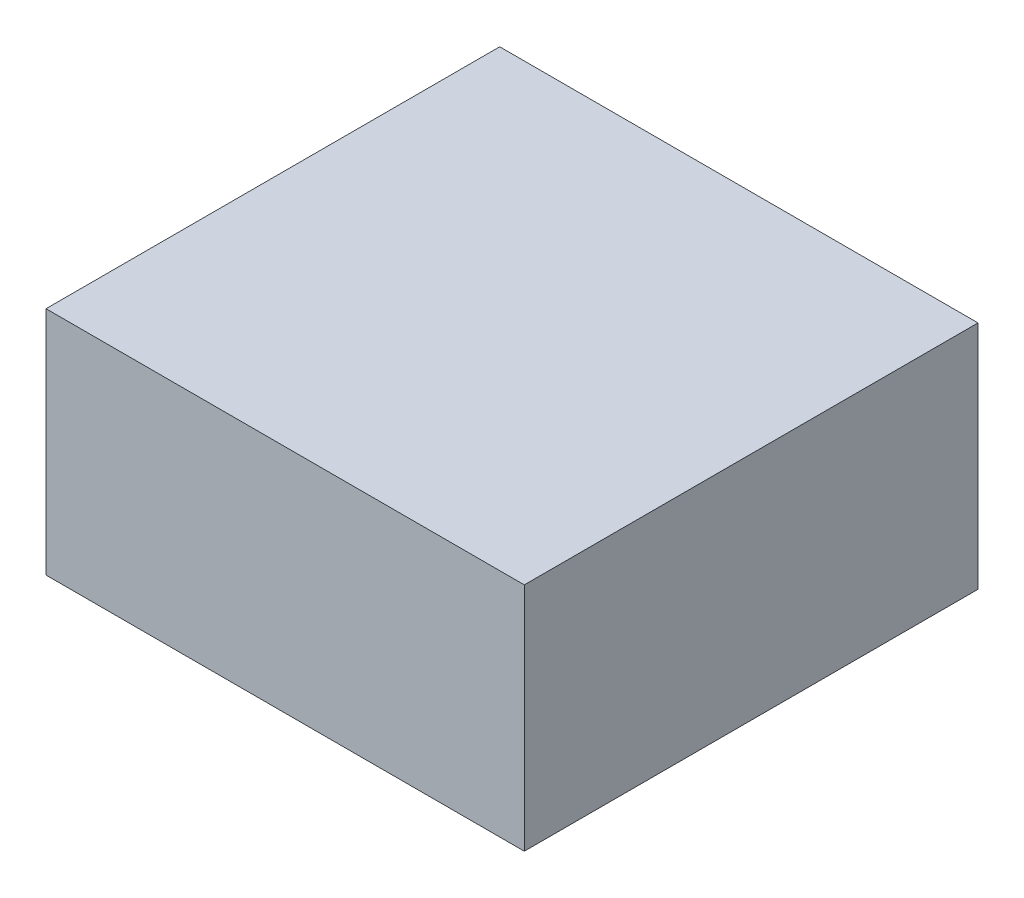
ISO-10303-21;
HEADER;
FILE_DESCRIPTION(('STEP AP214'),'2;1');
FILE_NAME('part.step','',(''),(''),'','','');
FILE_SCHEMA(('AUTOMOTIVE_DESIGN { 1 0 10303 214 1 1 1 1 }'));
ENDSEC;
DATA;
#1=APPLICATION_CONTEXT('core data for automotive mechanical design processes');
#2=APPLICATION_PROTOCOL_DEFINITION('international standard','automotive_design',2000,#1);
#3=PRODUCT_CONTEXT('',#1,'mechanical');
#4=PRODUCT('Part','Part','',(#3));
#5=PRODUCT_RELATED_PRODUCT_CATEGORY('part','',(#4));
#6=PRODUCT_DEFINITION_FORMATION('','',#4);
#7=PRODUCT_DEFINITION_CONTEXT('part definition',#1,'design');
#8=PRODUCT_DEFINITION('design','',#6,#7);
#9=PRODUCT_DEFINITION_SHAPE('','',#8);
#10=(LENGTH_UNIT() NAMED_UNIT(*) SI_UNIT(.MILLI.,.METRE.));
#11=(NAMED_UNIT(*) PLANE_ANGLE_UNIT() SI_UNIT($,.RADIAN.));
#12=(NAMED_UNIT(*) SI_UNIT($,.STERADIAN.) SOLID_ANGLE_UNIT());
#13=UNCERTAINTY_MEASURE_WITH_UNIT(LENGTH_MEASURE(1.E-05),#10,'distance_accuracy_value','');
#14=(GEOMETRIC_REPRESENTATION_CONTEXT(3) GLOBAL_UNCERTAINTY_ASSIGNED_CONTEXT((#13)) GLOBAL_UNIT_ASSIGNED_CONTEXT((#10,
#11,#12)) REPRESENTATION_CONTEXT('',''));
#15=CARTESIAN_POINT('',(0.,0.,0.));
#16=DIRECTION('',(0.,0.,1.));
#17=DIRECTION('',(1.,0.,0.));
#18=AXIS2_PLACEMENT_3D('',#15,#16,#17);
#19=CARTESIAN_POINT('',(39.497,-19.05,74.93));
#20=DIRECTION('',(-1.,0.,0.));
#21=DIRECTION('',(0.,0.,1.));
#22=AXIS2_PLACEMENT_3D('',#19,#20,#21);
#23=PLANE('',#22);
#24=DIRECTION('',(0.,1.,0.));
#25=VECTOR('',#24,1.);
#26=CARTESIAN_POINT('',(39.497,-19.05,0.));
#27=LINE('',#26,#25);
#28=CARTESIAN_POINT('',(39.497,-19.05,0.));
#29=VERTEX_POINT('',#28);
#30=CARTESIAN_POINT('',(39.497,19.05,0.));
#31=VERTEX_POINT('',#30);
#32=EDGE_CURVE('E95',#29,#31,#27,.T.);
#33=ORIENTED_EDGE('',*,*,#32,.T.);
#34=DIRECTION('',(0.,0.,-1.));
#35=VECTOR('',#34,1.);
#36=CARTESIAN_POINT('',(39.497,19.05,74.93));
#37=LINE('',#36,#35);
#38=CARTESIAN_POINT('',(39.497,19.05,74.93));
#39=VERTEX_POINT('',#38);
#40=EDGE_CURVE('E11',#39,#31,#37,.T.);
#41=ORIENTED_EDGE('',*,*,#40,.F.);
#42=DIRECTION('',(0.,1.,0.));
#43=VECTOR('',#42,1.);
#44=CARTESIAN_POINT('',(39.497,-19.05,74.93));
#45=LINE('',#44,#43);
#46=CARTESIAN_POINT('',(39.497,-19.05,74.93));
#47=VERTEX_POINT('',#46);
#48=EDGE_CURVE('E83',#47,#39,#45,.T.);
#49=ORIENTED_EDGE('',*,*,#48,.F.);
#50=DIRECTION('',(0.,0.,-1.));
#51=VECTOR('',#50,1.);
#52=CARTESIAN_POINT('',(39.497,-19.05,74.93));
#53=LINE('',#52,#51);
#54=EDGE_CURVE('E91',#47,#29,#53,.T.);
#55=ORIENTED_EDGE('',*,*,#54,.T.);
#56=EDGE_LOOP('',(#33,#41,#49,#55));
#57=FACE_BOUND('',#56,.T.);
#58=ADVANCED_FACE('F32',(#57),#23,.F.);
#59=CARTESIAN_POINT('',(-39.497,19.05,74.93));
#60=DIRECTION('',(0.,-1.,0.));
#61=DIRECTION('',(0.,0.,-1.));
#62=AXIS2_PLACEMENT_3D('',#59,#60,#61);
#63=PLANE('',#62);
#64=DIRECTION('',(-1.,0.,0.));
#65=VECTOR('',#64,1.);
#66=CARTESIAN_POINT('',(-39.497,19.05,0.));
#67=LINE('',#66,#65);
#68=CARTESIAN_POINT('',(-39.497,19.05,0.));
#69=VERTEX_POINT('',#68);
#70=EDGE_CURVE('E87',#31,#69,#67,.T.);
#71=ORIENTED_EDGE('',*,*,#70,.T.);
#72=DIRECTION('',(0.,0.,-1.));
#73=VECTOR('',#72,1.);
#74=CARTESIAN_POINT('',(-39.497,19.05,74.93));
#75=LINE('',#74,#73);
#76=CARTESIAN_POINT('',(-39.497,19.05,74.93));
#77=VERTEX_POINT('',#76);
#78=EDGE_CURVE('E40',#77,#69,#75,.T.);
#79=ORIENTED_EDGE('',*,*,#78,.F.);
#80=DIRECTION('',(-1.,0.,0.));
#81=VECTOR('',#80,1.);
#82=CARTESIAN_POINT('',(-39.497,19.05,74.93));
#83=LINE('',#82,#81);
#84=EDGE_CURVE('E78',#39,#77,#83,.T.);
#85=ORIENTED_EDGE('',*,*,#84,.F.);
#86=ORIENTED_EDGE('',*,*,#40,.T.);
#87=EDGE_LOOP('',(#71,#79,#85,#86));
#88=FACE_BOUND('',#87,.T.);
#89=ADVANCED_FACE('F86',(#88),#63,.F.);
#90=CARTESIAN_POINT('',(-39.497,-19.05,74.93));
#91=DIRECTION('',(1.,0.,0.));
#92=DIRECTION('',(0.,0.,-1.));
#93=AXIS2_PLACEMENT_3D('',#90,#91,#92);
#94=PLANE('',#93);
#95=DIRECTION('',(0.,-1.,0.));
#96=VECTOR('',#95,1.);
#97=CARTESIAN_POINT('',(-39.497,-19.05,0.));
#98=LINE('',#97,#96);
#99=CARTESIAN_POINT('',(-39.497,-19.05,0.));
#100=VERTEX_POINT('',#99);
#101=EDGE_CURVE('E65',#69,#100,#98,.T.);
#102=ORIENTED_EDGE('',*,*,#101,.T.);
#103=DIRECTION('',(0.,0.,-1.));
#104=VECTOR('',#103,1.);
#105=CARTESIAN_POINT('',(-39.497,-19.05,74.93));
#106=LINE('',#105,#104);
#107=CARTESIAN_POINT('',(-39.497,-19.05,74.93));
#108=VERTEX_POINT('',#107);
#109=EDGE_CURVE('E88',#108,#100,#106,.T.);
#110=ORIENTED_EDGE('',*,*,#109,.F.);
#111=DIRECTION('',(0.,-1.,0.));
#112=VECTOR('',#111,1.);
#113=CARTESIAN_POINT('',(-39.497,-19.05,74.93));
#114=LINE('',#113,#112);
#115=EDGE_CURVE('E81',#77,#108,#114,.T.);
#116=ORIENTED_EDGE('',*,*,#115,.F.);
#117=ORIENTED_EDGE('',*,*,#78,.T.);
#118=EDGE_LOOP('',(#102,#110,#116,#117));
#119=FACE_BOUND('',#118,.T.);
#120=ADVANCED_FACE('F89',(#119),#94,.F.);
#121=CARTESIAN_POINT('',(-39.497,-19.05,74.93));
#122=DIRECTION('',(0.,1.,0.));
#123=DIRECTION('',(0.,0.,1.));
#124=AXIS2_PLACEMENT_3D('',#121,#122,#123);
#125=PLANE('',#124);
#126=DIRECTION('',(1.,0.,0.));
#127=VECTOR('',#126,1.);
#128=CARTESIAN_POINT('',(-39.497,-19.05,0.));
#129=LINE('',#128,#127);
#130=EDGE_CURVE('E71',#100,#29,#129,.T.);
#131=ORIENTED_EDGE('',*,*,#130,.T.);
#132=ORIENTED_EDGE('',*,*,#54,.F.);
#133=DIRECTION('',(1.,0.,0.));
#134=VECTOR('',#133,1.);
#135=CARTESIAN_POINT('',(-39.497,-19.05,74.93));
#136=LINE('',#135,#134);
#137=EDGE_CURVE('E48',#108,#47,#136,.T.);
#138=ORIENTED_EDGE('',*,*,#137,.F.);
#139=ORIENTED_EDGE('',*,*,#109,.T.);
#140=EDGE_LOOP('',(#131,#132,#138,#139));
#141=FACE_BOUND('',#140,.T.);
#142=ADVANCED_FACE('F102',(#141),#125,.F.);
#143=CARTESIAN_POINT('',(0.,0.,74.93));
#144=DIRECTION('',(0.,0.,-1.));
#145=DIRECTION('',(-1.,0.,0.));
#146=AXIS2_PLACEMENT_3D('',#143,#144,#145);
#147=PLANE('',#146);
#148=ORIENTED_EDGE('',*,*,#48,.T.);
#149=ORIENTED_EDGE('',*,*,#84,.T.);
#150=ORIENTED_EDGE('',*,*,#115,.T.);
#151=ORIENTED_EDGE('',*,*,#137,.T.);
#152=EDGE_LOOP('',(#148,#149,#150,#151));
#153=FACE_BOUND('',#152,.T.);
#154=ADVANCED_FACE('F79',(#153),#147,.F.);
#155=CARTESIAN_POINT('',(0.,0.,0.));
#156=DIRECTION('',(0.,0.,-1.));
#157=DIRECTION('',(-1.,0.,0.));
#158=AXIS2_PLACEMENT_3D('',#155,#156,#157);
#159=PLANE('',#158);
#160=ORIENTED_EDGE('',*,*,#32,.F.);
#161=ORIENTED_EDGE('',*,*,#130,.F.);
#162=ORIENTED_EDGE('',*,*,#101,.F.);
#163=ORIENTED_EDGE('',*,*,#70,.F.);
#164=EDGE_LOOP('',(#160,#161,#162,#163));
#165=FACE_BOUND('',#164,.T.);
#166=ADVANCED_FACE('F105',(#165),#159,.T.);
#167=CLOSED_SHELL('',(#58,#89,#120,#142,#154,#166));
#168=MANIFOLD_SOLID_BREP('B2',#167);
#169=ADVANCED_BREP_SHAPE_REPRESENTATION('',(#18,#168),#14);
#170=SHAPE_DEFINITION_REPRESENTATION(#9,#169);
ENDSEC;
END-ISO-10303-21;
